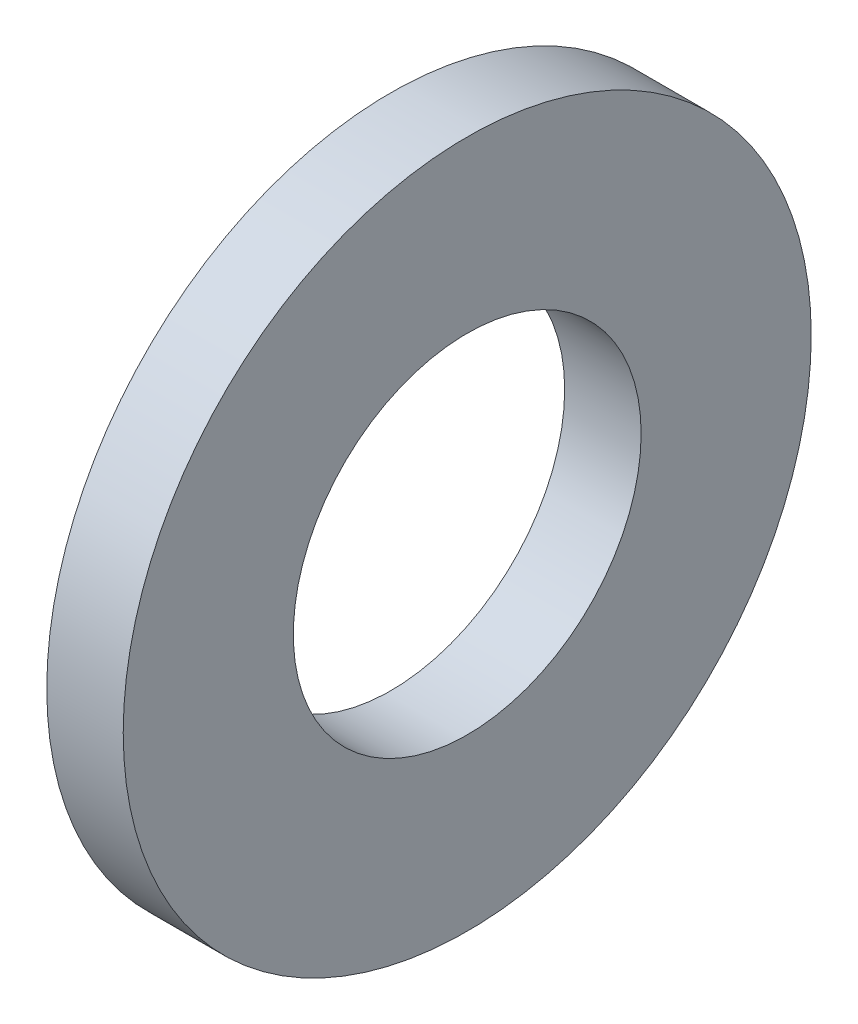
ISO-10303-21;
HEADER;
FILE_DESCRIPTION(('STEP AP214'),'2;1');
FILE_NAME('part.step','',(''),(''),'','','');
FILE_SCHEMA(('AUTOMOTIVE_DESIGN { 1 0 10303 214 1 1 1 1 }'));
ENDSEC;
DATA;
#1=APPLICATION_CONTEXT('core data for automotive mechanical design processes');
#2=APPLICATION_PROTOCOL_DEFINITION('international standard','automotive_design',2000,#1);
#3=PRODUCT_CONTEXT('',#1,'mechanical');
#4=PRODUCT('Part','Part','',(#3));
#5=PRODUCT_RELATED_PRODUCT_CATEGORY('part','',(#4));
#6=PRODUCT_DEFINITION_FORMATION('','',#4);
#7=PRODUCT_DEFINITION_CONTEXT('part definition',#1,'design');
#8=PRODUCT_DEFINITION('design','',#6,#7);
#9=PRODUCT_DEFINITION_SHAPE('','',#8);
#10=(LENGTH_UNIT() NAMED_UNIT(*) SI_UNIT(.MILLI.,.METRE.));
#11=(NAMED_UNIT(*) PLANE_ANGLE_UNIT() SI_UNIT($,.RADIAN.));
#12=(NAMED_UNIT(*) SI_UNIT($,.STERADIAN.) SOLID_ANGLE_UNIT());
#13=UNCERTAINTY_MEASURE_WITH_UNIT(LENGTH_MEASURE(1.E-05),#10,'distance_accuracy_value','');
#14=(GEOMETRIC_REPRESENTATION_CONTEXT(3) GLOBAL_UNCERTAINTY_ASSIGNED_CONTEXT((#13)) GLOBAL_UNIT_ASSIGNED_CONTEXT((#10,
#11,#12)) REPRESENTATION_CONTEXT('',''));
#15=CARTESIAN_POINT('',(0.,0.,0.));
#16=DIRECTION('',(0.,0.,1.));
#17=DIRECTION('',(1.,0.,0.));
#18=AXIS2_PLACEMENT_3D('',#15,#16,#17);
#19=CARTESIAN_POINT('',(1.,0.,0.));
#20=DIRECTION('',(1.,0.,0.));
#21=DIRECTION('',(0.,0.,-1.));
#22=AXIS2_PLACEMENT_3D('',#19,#20,#21);
#23=PLANE('',#22);
#24=CARTESIAN_POINT('',(1.,0.,0.));
#25=DIRECTION('',(1.,0.,0.));
#26=DIRECTION('',(0.,0.,-1.));
#27=AXIS2_PLACEMENT_3D('',#24,#25,#26);
#28=CIRCLE('',#27,4.5);
#29=CARTESIAN_POINT('',(1.,0.,-4.5));
#30=VERTEX_POINT('',#29);
#31=EDGE_CURVE('E10',#30,#30,#28,.T.);
#32=ORIENTED_EDGE('',*,*,#31,.T.);
#33=EDGE_LOOP('',(#32));
#34=FACE_BOUND('',#33,.T.);
#35=CARTESIAN_POINT('',(1.,0.,0.));
#36=DIRECTION('',(1.,0.,0.));
#37=DIRECTION('',(0.,0.,-1.));
#38=AXIS2_PLACEMENT_3D('',#35,#36,#37);
#39=CIRCLE('',#38,2.275);
#40=CARTESIAN_POINT('',(1.,0.,-2.275));
#41=VERTEX_POINT('',#40);
#42=EDGE_CURVE('E42',#41,#41,#39,.T.);
#43=ORIENTED_EDGE('',*,*,#42,.F.);
#44=EDGE_LOOP('',(#43));
#45=FACE_BOUND('',#44,.T.);
#46=ADVANCED_FACE('F31',(#34,#45),#23,.T.);
#47=CARTESIAN_POINT('',(0.,0.,0.));
#48=DIRECTION('',(1.,0.,0.));
#49=DIRECTION('',(0.,0.,-1.));
#50=AXIS2_PLACEMENT_3D('',#47,#48,#49);
#51=PLANE('',#50);
#52=CARTESIAN_POINT('',(0.,0.,0.));
#53=DIRECTION('',(1.,0.,0.));
#54=DIRECTION('',(0.,0.,-1.));
#55=AXIS2_PLACEMENT_3D('',#52,#53,#54);
#56=CIRCLE('',#55,4.5);
#57=CARTESIAN_POINT('',(0.,0.,-4.5));
#58=VERTEX_POINT('',#57);
#59=EDGE_CURVE('E35',#58,#58,#56,.T.);
#60=ORIENTED_EDGE('',*,*,#59,.F.);
#61=EDGE_LOOP('',(#60));
#62=FACE_BOUND('',#61,.T.);
#63=CARTESIAN_POINT('',(0.,0.,0.));
#64=DIRECTION('',(1.,0.,0.));
#65=DIRECTION('',(0.,0.,-1.));
#66=AXIS2_PLACEMENT_3D('',#63,#64,#65);
#67=CIRCLE('',#66,2.275);
#68=CARTESIAN_POINT('',(0.,0.,-2.275));
#69=VERTEX_POINT('',#68);
#70=EDGE_CURVE('E44',#69,#69,#67,.T.);
#71=ORIENTED_EDGE('',*,*,#70,.T.);
#72=EDGE_LOOP('',(#71));
#73=FACE_BOUND('',#72,.T.);
#74=ADVANCED_FACE('F54',(#62,#73),#51,.F.);
#75=CARTESIAN_POINT('',(1.,0.,0.));
#76=DIRECTION('',(-1.,0.,0.));
#77=DIRECTION('',(0.,0.,1.));
#78=AXIS2_PLACEMENT_3D('',#75,#76,#77);
#79=CYLINDRICAL_SURFACE('',#78,4.5);
#80=ORIENTED_EDGE('',*,*,#31,.F.);
#81=EDGE_LOOP('',(#80));
#82=FACE_BOUND('',#81,.T.);
#83=ORIENTED_EDGE('',*,*,#59,.T.);
#84=EDGE_LOOP('',(#83));
#85=FACE_BOUND('',#84,.T.);
#86=ADVANCED_FACE('F33',(#82,#85),#79,.T.);
#87=CARTESIAN_POINT('',(1.,0.,0.));
#88=DIRECTION('',(-1.,0.,0.));
#89=DIRECTION('',(0.,0.,1.));
#90=AXIS2_PLACEMENT_3D('',#87,#88,#89);
#91=CYLINDRICAL_SURFACE('',#90,2.275);
#92=ORIENTED_EDGE('',*,*,#42,.T.);
#93=EDGE_LOOP('',(#92));
#94=FACE_BOUND('',#93,.T.);
#95=ORIENTED_EDGE('',*,*,#70,.F.);
#96=EDGE_LOOP('',(#95));
#97=FACE_BOUND('',#96,.T.);
#98=ADVANCED_FACE('F50',(#94,#97),#91,.F.);
#99=CLOSED_SHELL('',(#46,#74,#86,#98));
#100=MANIFOLD_SOLID_BREP('B2',#99);
#101=ADVANCED_BREP_SHAPE_REPRESENTATION('',(#18,#100),#14);
#102=SHAPE_DEFINITION_REPRESENTATION(#9,#101);
ENDSEC;
END-ISO-10303-21;
